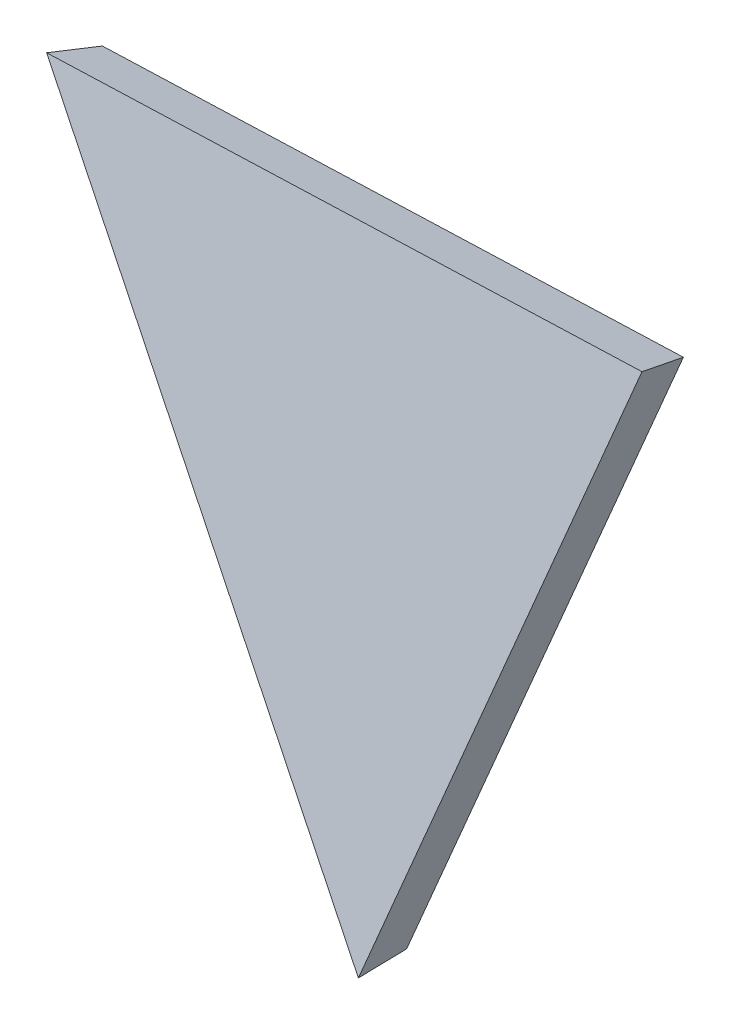
ISO-10303-21;
HEADER;
FILE_DESCRIPTION(('STEP AP214'),'2;1');
FILE_NAME('part.step','',(''),(''),'','','');
FILE_SCHEMA(('AUTOMOTIVE_DESIGN { 1 0 10303 214 1 1 1 1 }'));
ENDSEC;
DATA;
#1=APPLICATION_CONTEXT('core data for automotive mechanical design processes');
#2=APPLICATION_PROTOCOL_DEFINITION('international standard','automotive_design',2000,#1);
#3=PRODUCT_CONTEXT('',#1,'mechanical');
#4=PRODUCT('Part','Part','',(#3));
#5=PRODUCT_RELATED_PRODUCT_CATEGORY('part','',(#4));
#6=PRODUCT_DEFINITION_FORMATION('','',#4);
#7=PRODUCT_DEFINITION_CONTEXT('part definition',#1,'design');
#8=PRODUCT_DEFINITION('design','',#6,#7);
#9=PRODUCT_DEFINITION_SHAPE('','',#8);
#10=(LENGTH_UNIT() NAMED_UNIT(*) SI_UNIT(.MILLI.,.METRE.));
#11=(NAMED_UNIT(*) PLANE_ANGLE_UNIT() SI_UNIT($,.RADIAN.));
#12=(NAMED_UNIT(*) SI_UNIT($,.STERADIAN.) SOLID_ANGLE_UNIT());
#13=UNCERTAINTY_MEASURE_WITH_UNIT(LENGTH_MEASURE(1.E-05),#10,'distance_accuracy_value','');
#14=(GEOMETRIC_REPRESENTATION_CONTEXT(3) GLOBAL_UNCERTAINTY_ASSIGNED_CONTEXT((#13)) GLOBAL_UNIT_ASSIGNED_CONTEXT((#10,
#11,#12)) REPRESENTATION_CONTEXT('',''));
#15=CARTESIAN_POINT('',(0.,0.,0.));
#16=DIRECTION('',(0.,0.,1.));
#17=DIRECTION('',(1.,0.,0.));
#18=AXIS2_PLACEMENT_3D('',#15,#16,#17);
#19=CARTESIAN_POINT('',(5.92931005239501,-665.361206904774,-3337.3364297781));
#20=DIRECTION('',(0.00174236633575095,-0.195520719574652,-0.980698023030822));
#21=DIRECTION('',(0.,0.980699511655574,-0.195521016360182));
#22=AXIS2_PLACEMENT_3D('',#19,#20,#21);
#23=PLANE('',#22);
#24=DIRECTION('',(0.999487976226041,0.0316730794579162,-0.00453887841053892));
#25=VECTOR('',#24,1.);
#26=CARTESIAN_POINT('',(208.618547143317,-6883.78707844153,-2097.21538194603));
#27=LINE('',#26,#25);
#28=CARTESIAN_POINT('',(-3087.31570646137,-6988.23294471064,-2082.24787339958));
#29=VERTEX_POINT('',#28);
#30=CARTESIAN_POINT('',(-2279.99446016723,-6962.64949539443,-2085.91408356152));
#31=VERTEX_POINT('',#30);
#32=EDGE_CURVE('E50',#29,#31,#27,.T.);
#33=ORIENTED_EDGE('',*,*,#32,.T.);
#34=DIRECTION('',(-0.2917562783292,-0.938131178163961,0.18651586155658));
#35=VECTOR('',#34,1.);
#36=CARTESIAN_POINT('',(-293.710362085938,-575.828784037546,-3355.71877112935));
#37=LINE('',#36,#35);
#38=CARTESIAN_POINT('',(-2515.6561667985,-7720.41071909866,-1935.25872663161));
#39=VERTEX_POINT('',#38);
#40=EDGE_CURVE('E82',#31,#39,#37,.T.);
#41=ORIENTED_EDGE('',*,*,#40,.T.);
#42=DIRECTION('',(-0.607844211167118,0.778522863397756,-0.156293205602749));
#43=VECTOR('',#42,1.);
#44=CARTESIAN_POINT('',(-5055.78936774136,-4467.0248404824,-2588.39575309279));
#45=LINE('',#44,#43);
#46=EDGE_CURVE('E87',#39,#29,#45,.T.);
#47=ORIENTED_EDGE('',*,*,#46,.T.);
#48=EDGE_LOOP('',(#33,#41,#47));
#49=FACE_BOUND('',#48,.T.);
#50=ADVANCED_FACE('F34',(#49),#23,.T.);
#51=CARTESIAN_POINT('',(5.80734440889249,-651.674756534548,-3268.68756816594));
#52=DIRECTION('',(0.00174236633575095,-0.195520719574652,-0.980698023030822));
#53=DIRECTION('',(0.,0.980699511655574,-0.195521016360182));
#54=AXIS2_PLACEMENT_3D('',#51,#52,#53);
#55=PLANE('',#54);
#56=DIRECTION('',(-0.999487976226041,-0.0316730794579162,0.00453887841053892));
#57=VECTOR('',#56,1.);
#58=CARTESIAN_POINT('',(-3097.83405181701,-6967.99010189366,-2014.92462358687));
#59=LINE('',#58,#57);
#60=CARTESIAN_POINT('',(-2270.54440801704,-6941.77386793582,-2018.68151430774));
#61=VERTEX_POINT('',#60);
#62=CARTESIAN_POINT('',(-3097.83405181701,-6967.99010189366,-2014.92462358687));
#63=VERTEX_POINT('',#62);
#64=EDGE_CURVE('E71',#61,#63,#59,.T.);
#65=ORIENTED_EDGE('',*,*,#64,.T.);
#66=DIRECTION('',(0.607844211167118,-0.778522863397756,0.156293205602749));
#67=VECTOR('',#66,1.);
#68=CARTESIAN_POINT('',(-2512.035004519,-7718.27766456116,-1864.29982654316));
#69=LINE('',#68,#67);
#70=CARTESIAN_POINT('',(-2512.035004519,-7718.27766456116,-1864.29982654316));
#71=VERTEX_POINT('',#70);
#72=EDGE_CURVE('E73',#63,#71,#69,.T.);
#73=ORIENTED_EDGE('',*,*,#72,.T.);
#74=DIRECTION('',(0.2917562783292,0.938131178163961,-0.18651586155658));
#75=VECTOR('',#74,1.);
#76=CARTESIAN_POINT('',(-2270.54440801704,-6941.77386793582,-2018.68151430774));
#77=LINE('',#76,#75);
#78=EDGE_CURVE('E75',#71,#61,#77,.T.);
#79=ORIENTED_EDGE('',*,*,#78,.T.);
#80=EDGE_LOOP('',(#65,#73,#79));
#81=FACE_BOUND('',#80,.T.);
#82=ADVANCED_FACE('F72',(#81),#55,.F.);
#83=CARTESIAN_POINT('',(-2512.035004519,-7718.27766456116,-1864.29982654315));
#84=DIRECTION('',(0.792532004913171,0.60699949397593,-0.0586910172111147));
#85=DIRECTION('',(0.607844211167118,-0.778522863397756,0.156293205602749));
#86=AXIS2_PLACEMENT_3D('',#83,#84,#85);
#87=PLANE('',#86);
#88=ORIENTED_EDGE('',*,*,#46,.F.);
#89=DIRECTION('',(0.0509425546510279,0.03000783697697,0.998250662832533));
#90=VECTOR('',#89,1.);
#91=CARTESIAN_POINT('',(-2512.035004519,-7718.27766456116,-1864.29982654315));
#92=LINE('',#91,#90);
#93=EDGE_CURVE('E11',#39,#71,#92,.T.);
#94=ORIENTED_EDGE('',*,*,#93,.T.);
#95=ORIENTED_EDGE('',*,*,#72,.F.);
#96=DIRECTION('',(0.14797220940683,-0.284776557055865,-0.947104290875439));
#97=VECTOR('',#96,1.);
#98=CARTESIAN_POINT('',(-3074.50047738774,-7012.89620295421,-2164.27245418302));
#99=LINE('',#98,#97);
#100=EDGE_CURVE('E43',#63,#29,#99,.T.);
#101=ORIENTED_EDGE('',*,*,#100,.T.);
#102=EDGE_LOOP('',(#88,#94,#95,#101));
#103=FACE_BOUND('',#102,.T.);
#104=ADVANCED_FACE('F79',(#103),#87,.F.);
#105=CARTESIAN_POINT('',(-3097.83405181701,-6967.99010189366,-2014.92462358686));
#106=DIRECTION('',(0.0316160052863785,-0.955794975123661,0.29232925569996));
#107=DIRECTION('',(-0.999487976226041,-0.0316730794579162,0.00453887841053892));
#108=AXIS2_PLACEMENT_3D('',#105,#106,#107);
#109=PLANE('',#108);
#110=ORIENTED_EDGE('',*,*,#100,.F.);
#111=ORIENTED_EDGE('',*,*,#64,.F.);
#112=DIRECTION('',(-0.133042414817532,-0.293897202236073,-0.946532699053407));
#113=VECTOR('',#112,1.);
#114=CARTESIAN_POINT('',(-2285.73964385244,-6975.34088718652,-2126.78829820634));
#115=LINE('',#114,#113);
#116=EDGE_CURVE('E38',#31,#61,#115,.F.);
#117=ORIENTED_EDGE('',*,*,#116,.F.);
#118=ORIENTED_EDGE('',*,*,#32,.F.);
#119=EDGE_LOOP('',(#110,#111,#117,#118));
#120=FACE_BOUND('',#119,.T.);
#121=ADVANCED_FACE('F36',(#120),#109,.F.);
#122=CARTESIAN_POINT('',(-2270.54440801704,-6941.77386793582,-2018.68151430773));
#123=DIRECTION('',(-0.951894070237499,0.30387825382299,0.0394421842724104));
#124=DIRECTION('',(0.2917562783292,0.938131178163961,-0.18651586155658));
#125=AXIS2_PLACEMENT_3D('',#122,#123,#124);
#126=PLANE('',#125);
#127=ORIENTED_EDGE('',*,*,#93,.F.);
#128=ORIENTED_EDGE('',*,*,#40,.F.);
#129=ORIENTED_EDGE('',*,*,#116,.T.);
#130=ORIENTED_EDGE('',*,*,#78,.F.);
#131=EDGE_LOOP('',(#127,#128,#129,#130));
#132=FACE_BOUND('',#131,.T.);
#133=ADVANCED_FACE('F90',(#132),#126,.F.);
#134=CLOSED_SHELL('',(#50,#82,#104,#121,#133));
#135=MANIFOLD_SOLID_BREP('B2',#134);
#136=ADVANCED_BREP_SHAPE_REPRESENTATION('',(#18,#135),#14);
#137=SHAPE_DEFINITION_REPRESENTATION(#9,#136);
ENDSEC;
END-ISO-10303-21;
